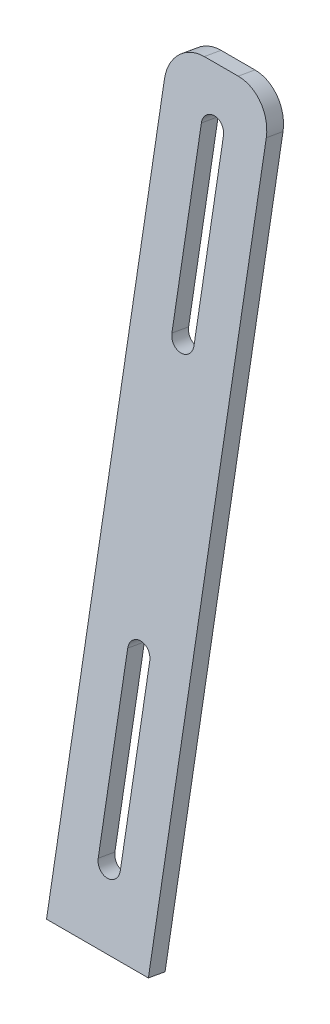
ISO-10303-21;
HEADER;
FILE_DESCRIPTION(('STEP AP214'),'2;1');
FILE_NAME('part.step','',(''),(''),'','','');
FILE_SCHEMA(('AUTOMOTIVE_DESIGN { 1 0 10303 214 1 1 1 1 }'));
ENDSEC;
DATA;
#1=APPLICATION_CONTEXT('core data for automotive mechanical design processes');
#2=APPLICATION_PROTOCOL_DEFINITION('international standard','automotive_design',2000,#1);
#3=PRODUCT_CONTEXT('',#1,'mechanical');
#4=PRODUCT('Part','Part','',(#3));
#5=PRODUCT_RELATED_PRODUCT_CATEGORY('part','',(#4));
#6=PRODUCT_DEFINITION_FORMATION('','',#4);
#7=PRODUCT_DEFINITION_CONTEXT('part definition',#1,'design');
#8=PRODUCT_DEFINITION('design','',#6,#7);
#9=PRODUCT_DEFINITION_SHAPE('','',#8);
#10=(LENGTH_UNIT() NAMED_UNIT(*) SI_UNIT(.MILLI.,.METRE.));
#11=(NAMED_UNIT(*) PLANE_ANGLE_UNIT() SI_UNIT($,.RADIAN.));
#12=(NAMED_UNIT(*) SI_UNIT($,.STERADIAN.) SOLID_ANGLE_UNIT());
#13=UNCERTAINTY_MEASURE_WITH_UNIT(LENGTH_MEASURE(1.E-05),#10,'distance_accuracy_value','');
#14=(GEOMETRIC_REPRESENTATION_CONTEXT(3) GLOBAL_UNCERTAINTY_ASSIGNED_CONTEXT((#13)) GLOBAL_UNIT_ASSIGNED_CONTEXT((#10,
#11,#12)) REPRESENTATION_CONTEXT('',''));
#15=CARTESIAN_POINT('',(0.,0.,0.));
#16=DIRECTION('',(0.,0.,1.));
#17=DIRECTION('',(1.,0.,0.));
#18=AXIS2_PLACEMENT_3D('',#15,#16,#17);
#19=CARTESIAN_POINT('',(-15.,231.809628132565,-597.966117310056));
#20=DIRECTION('',(1.,0.,0.));
#21=DIRECTION('',(0.,0.,-1.));
#22=AXIS2_PLACEMENT_3D('',#19,#20,#21);
#23=PLANE('',#22);
#24=DIRECTION('',(0.,-0.984807753012209,0.173648177666928));
#25=VECTOR('',#24,1.);
#26=CARTESIAN_POINT('',(-15.,231.809628132565,-597.966117310056));
#27=LINE('',#26,#25);
#28=CARTESIAN_POINT('',(-15.,221.961550602443,-596.229635533386));
#29=VERTEX_POINT('',#28);
#30=CARTESIAN_POINT('',(-15.0000000000001,25.0000000000006,-561.5));
#31=VERTEX_POINT('',#30);
#32=EDGE_CURVE('E235',#29,#31,#27,.T.);
#33=ORIENTED_EDGE('',*,*,#32,.F.);
#34=DIRECTION('',(0.,0.173648177666924,0.984807753012209));
#35=VECTOR('',#34,1.);
#36=CARTESIAN_POINT('',(-15.,221.961550602443,-596.229635533386));
#37=LINE('',#36,#35);
#38=CARTESIAN_POINT('',(-15.,221.093309714108,-601.153674298447));
#39=VERTEX_POINT('',#38);
#40=EDGE_CURVE('E57',#29,#39,#37,.F.);
#41=ORIENTED_EDGE('',*,*,#40,.T.);
#42=DIRECTION('',(0.,-0.984807753012209,0.173648177666928));
#43=VECTOR('',#42,1.);
#44=CARTESIAN_POINT('',(-15.0000000000001,230.94138724423,-602.890156075116));
#45=LINE('',#44,#43);
#46=CARTESIAN_POINT('',(-15.,24.1317591116659,-566.424038765062));
#47=VERTEX_POINT('',#46);
#48=EDGE_CURVE('E219',#39,#47,#45,.T.);
#49=ORIENTED_EDGE('',*,*,#48,.T.);
#50=DIRECTION('',(0.,0.173648177666924,0.984807753012209));
#51=VECTOR('',#50,1.);
#52=CARTESIAN_POINT('',(-15.0000000000001,25.0000000000006,-561.5));
#53=LINE('',#52,#51);
#54=EDGE_CURVE('E211',#47,#31,#53,.T.);
#55=ORIENTED_EDGE('',*,*,#54,.T.);
#56=EDGE_LOOP('',(#33,#41,#49,#55));
#57=FACE_BOUND('',#56,.T.);
#58=ADVANCED_FACE('F34',(#57),#23,.F.);
#59=CARTESIAN_POINT('',(-15.,231.809628132565,-597.966117310056));
#60=DIRECTION('',(0.,-0.173648177666926,-0.984807753012209));
#61=DIRECTION('',(0.,0.984807753012209,-0.173648177666928));
#62=AXIS2_PLACEMENT_3D('',#59,#60,#61);
#63=PLANE('',#62);
#64=DIRECTION('',(0.,-0.984807753012209,0.173648177666928));
#65=VECTOR('',#64,1.);
#66=CARTESIAN_POINT('',(3.24999999999999,231.809628132564,-597.966117310056));
#67=LINE('',#66,#65);
#68=CARTESIAN_POINT('',(3.25,93.9365427108549,-573.655372436685));
#69=VERTEX_POINT('',#68);
#70=CARTESIAN_POINT('',(3.25,44.6961550602447,-564.972963553338));
#71=VERTEX_POINT('',#70);
#72=EDGE_CURVE('E205',#69,#71,#67,.T.);
#73=ORIENTED_EDGE('',*,*,#72,.T.);
#74=CARTESIAN_POINT('',(0.,44.6961550602447,-564.972963553339));
#75=DIRECTION('',(0.,-0.173648177666926,-0.984807753012209));
#76=DIRECTION('',(0.,0.984807753012209,-0.173648177666928));
#77=AXIS2_PLACEMENT_3D('',#74,#75,#76);
#78=CIRCLE('',#77,3.25);
#79=CARTESIAN_POINT('',(-3.25,44.6961550602447,-564.972963553338));
#80=VERTEX_POINT('',#79);
#81=EDGE_CURVE('E208',#71,#80,#78,.T.);
#82=ORIENTED_EDGE('',*,*,#81,.T.);
#83=DIRECTION('',(0.,0.984807753012209,-0.173648177666928));
#84=VECTOR('',#83,1.);
#85=CARTESIAN_POINT('',(-3.25000000000002,231.809628132564,-597.966117310056));
#86=LINE('',#85,#84);
#87=CARTESIAN_POINT('',(-3.24999999999999,93.9365427108549,-573.655372436685));
#88=VERTEX_POINT('',#87);
#89=EDGE_CURVE('E202',#80,#88,#86,.T.);
#90=ORIENTED_EDGE('',*,*,#89,.T.);
#91=CARTESIAN_POINT('',(0.,93.9365427108549,-573.655372436685));
#92=DIRECTION('',(0.,-0.173648177666926,-0.984807753012209));
#93=DIRECTION('',(0.,0.984807753012209,-0.173648177666928));
#94=AXIS2_PLACEMENT_3D('',#91,#92,#93);
#95=CIRCLE('',#94,3.25);
#96=EDGE_CURVE('E143',#88,#69,#95,.T.);
#97=ORIENTED_EDGE('',*,*,#96,.T.);
#98=EDGE_LOOP('',(#73,#82,#90,#97));
#99=FACE_BOUND('',#98,.T.);
#100=DIRECTION('',(0.,-0.984807753012209,0.173648177666928));
#101=VECTOR('',#100,1.);
#102=CARTESIAN_POINT('',(3.24999999999996,231.809628132564,-597.966117310056));
#103=LINE('',#102,#101);
#104=CARTESIAN_POINT('',(3.24999999999996,217.037511837381,-595.361394645051));
#105=VERTEX_POINT('',#104);
#106=CARTESIAN_POINT('',(3.24999999999995,167.797124186771,-586.678985761705));
#107=VERTEX_POINT('',#106);
#108=EDGE_CURVE('E196',#105,#107,#103,.T.);
#109=ORIENTED_EDGE('',*,*,#108,.T.);
#110=CARTESIAN_POINT('',(0.,167.797124186771,-586.678985761705));
#111=DIRECTION('',(0.,-0.173648177666926,-0.984807753012209));
#112=DIRECTION('',(0.,0.984807753012209,-0.173648177666928));
#113=AXIS2_PLACEMENT_3D('',#110,#111,#112);
#114=CIRCLE('',#113,3.25);
#115=CARTESIAN_POINT('',(-3.25000000000006,167.797124186771,-586.678985761705));
#116=VERTEX_POINT('',#115);
#117=EDGE_CURVE('E199',#107,#116,#114,.T.);
#118=ORIENTED_EDGE('',*,*,#117,.T.);
#119=DIRECTION('',(0.,0.984807753012209,-0.173648177666928));
#120=VECTOR('',#119,1.);
#121=CARTESIAN_POINT('',(-3.25000000000003,231.809628132564,-597.966117310056));
#122=LINE('',#121,#120);
#123=CARTESIAN_POINT('',(-3.25000000000004,217.037511837381,-595.361394645051));
#124=VERTEX_POINT('',#123);
#125=EDGE_CURVE('E184',#116,#124,#122,.T.);
#126=ORIENTED_EDGE('',*,*,#125,.T.);
#127=CARTESIAN_POINT('',(0.,217.037511837381,-595.361394645051));
#128=DIRECTION('',(0.,-0.173648177666926,-0.984807753012209));
#129=DIRECTION('',(0.,0.984807753012209,-0.173648177666928));
#130=AXIS2_PLACEMENT_3D('',#127,#128,#129);
#131=CIRCLE('',#130,3.25);
#132=EDGE_CURVE('E193',#124,#105,#131,.T.);
#133=ORIENTED_EDGE('',*,*,#132,.T.);
#134=EDGE_LOOP('',(#109,#118,#126,#133));
#135=FACE_BOUND('',#134,.T.);
#136=DIRECTION('',(1.,0.,0.));
#137=VECTOR('',#136,1.);
#138=CARTESIAN_POINT('',(-15.,231.809628132565,-597.966117310056));
#139=LINE('',#138,#137);
#140=CARTESIAN_POINT('',(-5.00000000000005,231.809628132564,-597.966117310056));
#141=VERTEX_POINT('',#140);
#142=CARTESIAN_POINT('',(4.99999999999995,231.809628132565,-597.966117310056));
#143=VERTEX_POINT('',#142);
#144=EDGE_CURVE('E212',#141,#143,#139,.T.);
#145=ORIENTED_EDGE('',*,*,#144,.F.);
#146=CARTESIAN_POINT('',(-5.,221.961550602443,-596.229635533386));
#147=DIRECTION('',(0.,-0.173648177666926,-0.984807753012209));
#148=DIRECTION('',(0.,0.984807753012209,-0.173648177666928));
#149=AXIS2_PLACEMENT_3D('',#146,#147,#148);
#150=CIRCLE('',#149,10.);
#151=EDGE_CURVE('E245',#141,#29,#150,.F.);
#152=ORIENTED_EDGE('',*,*,#151,.T.);
#153=ORIENTED_EDGE('',*,*,#32,.T.);
#154=DIRECTION('',(1.,0.,0.));
#155=VECTOR('',#154,1.);
#156=CARTESIAN_POINT('',(-15.0000000000001,25.0000000000006,-561.5));
#157=LINE('',#156,#155);
#158=CARTESIAN_POINT('',(14.9999999999999,25.0000000000006,-561.5));
#159=VERTEX_POINT('',#158);
#160=EDGE_CURVE('E222',#31,#159,#157,.T.);
#161=ORIENTED_EDGE('',*,*,#160,.T.);
#162=DIRECTION('',(0.,-0.984807753012209,0.173648177666928));
#163=VECTOR('',#162,1.);
#164=CARTESIAN_POINT('',(15.,231.809628132564,-597.966117310056));
#165=LINE('',#164,#163);
#166=CARTESIAN_POINT('',(15.,221.961550602443,-596.229635533386));
#167=VERTEX_POINT('',#166);
#168=EDGE_CURVE('E233',#167,#159,#165,.T.);
#169=ORIENTED_EDGE('',*,*,#168,.F.);
#170=CARTESIAN_POINT('',(4.99999999999999,221.961550602443,-596.229635533386));
#171=DIRECTION('',(0.,-0.173648177666926,-0.984807753012209));
#172=DIRECTION('',(0.,0.984807753012209,-0.173648177666928));
#173=AXIS2_PLACEMENT_3D('',#170,#171,#172);
#174=CIRCLE('',#173,10.);
#175=EDGE_CURVE('E243',#167,#143,#174,.F.);
#176=ORIENTED_EDGE('',*,*,#175,.T.);
#177=EDGE_LOOP('',(#145,#152,#153,#161,#169,#176));
#178=FACE_BOUND('',#177,.T.);
#179=ADVANCED_FACE('F257',(#99,#135,#178),#63,.F.);
#180=CARTESIAN_POINT('',(14.9999999999999,230.94138724423,-602.890156075116));
#181=DIRECTION('',(-1.,0.,0.));
#182=DIRECTION('',(0.,0.,1.));
#183=AXIS2_PLACEMENT_3D('',#180,#181,#182);
#184=PLANE('',#183);
#185=DIRECTION('',(0.,-0.984807753012209,0.173648177666928));
#186=VECTOR('',#185,1.);
#187=CARTESIAN_POINT('',(14.9999999999999,230.94138724423,-602.890156075116));
#188=LINE('',#187,#186);
#189=CARTESIAN_POINT('',(15.,221.093309714108,-601.153674298447));
#190=VERTEX_POINT('',#189);
#191=CARTESIAN_POINT('',(15.,24.1317591116659,-566.424038765062));
#192=VERTEX_POINT('',#191);
#193=EDGE_CURVE('E231',#190,#192,#188,.T.);
#194=ORIENTED_EDGE('',*,*,#193,.F.);
#195=DIRECTION('',(0.,-0.173648177666924,-0.984807753012209));
#196=VECTOR('',#195,1.);
#197=CARTESIAN_POINT('',(15.,221.093309714108,-601.153674298447));
#198=LINE('',#197,#196);
#199=EDGE_CURVE('E11',#190,#167,#198,.F.);
#200=ORIENTED_EDGE('',*,*,#199,.T.);
#201=ORIENTED_EDGE('',*,*,#168,.T.);
#202=DIRECTION('',(0.,-0.173648177666924,-0.984807753012209));
#203=VECTOR('',#202,1.);
#204=CARTESIAN_POINT('',(15.,24.1317591116659,-566.424038765062));
#205=LINE('',#204,#203);
#206=EDGE_CURVE('E225',#159,#192,#205,.T.);
#207=ORIENTED_EDGE('',*,*,#206,.T.);
#208=EDGE_LOOP('',(#194,#200,#201,#207));
#209=FACE_BOUND('',#208,.T.);
#210=ADVANCED_FACE('F269',(#209),#184,.F.);
#211=CARTESIAN_POINT('',(-15.0000000000001,230.94138724423,-602.890156075116));
#212=DIRECTION('',(0.,0.173648177666926,0.984807753012209));
#213=DIRECTION('',(0.,-0.984807753012209,0.173648177666928));
#214=AXIS2_PLACEMENT_3D('',#211,#212,#213);
#215=PLANE('',#214);
#216=DIRECTION('',(0.,0.984807753012209,-0.173648177666926));
#217=VECTOR('',#216,1.);
#218=CARTESIAN_POINT('',(-3.25,43.8279141719098,-569.897002318399));
#219=LINE('',#218,#217);
#220=CARTESIAN_POINT('',(-3.25,43.8279141719098,-569.8970023184));
#221=VERTEX_POINT('',#220);
#222=CARTESIAN_POINT('',(-3.24999999999999,93.0683018225207,-578.579411201746));
#223=VERTEX_POINT('',#222);
#224=EDGE_CURVE('E151',#221,#223,#219,.T.);
#225=ORIENTED_EDGE('',*,*,#224,.F.);
#226=CARTESIAN_POINT('',(0.,43.8279141719098,-569.897002318399));
#227=DIRECTION('',(0.,-0.173648177666924,-0.984807753012209));
#228=DIRECTION('',(0.,0.984807753012209,-0.173648177666926));
#229=AXIS2_PLACEMENT_3D('',#226,#227,#228);
#230=CIRCLE('',#229,3.25);
#231=CARTESIAN_POINT('',(3.24999999999999,43.8279141719098,-569.897002318399));
#232=VERTEX_POINT('',#231);
#233=EDGE_CURVE('E156',#232,#221,#230,.T.);
#234=ORIENTED_EDGE('',*,*,#233,.F.);
#235=DIRECTION('',(0.,-0.984807753012209,0.173648177666926));
#236=VECTOR('',#235,1.);
#237=CARTESIAN_POINT('',(3.24999999999999,43.8279141719098,-569.897002318399));
#238=LINE('',#237,#236);
#239=CARTESIAN_POINT('',(3.25,93.0683018225207,-578.579411201746));
#240=VERTEX_POINT('',#239);
#241=EDGE_CURVE('E161',#240,#232,#238,.T.);
#242=ORIENTED_EDGE('',*,*,#241,.F.);
#243=CARTESIAN_POINT('',(0.,93.0683018225207,-578.579411201746));
#244=DIRECTION('',(0.,-0.173648177666924,-0.984807753012209));
#245=DIRECTION('',(0.,0.984807753012209,-0.173648177666926));
#246=AXIS2_PLACEMENT_3D('',#243,#244,#245);
#247=CIRCLE('',#246,3.25);
#248=EDGE_CURVE('E140',#223,#240,#247,.T.);
#249=ORIENTED_EDGE('',*,*,#248,.F.);
#250=EDGE_LOOP('',(#225,#234,#242,#249));
#251=FACE_BOUND('',#250,.T.);
#252=DIRECTION('',(0.,0.984807753012209,-0.173648177666926));
#253=VECTOR('',#252,1.);
#254=CARTESIAN_POINT('',(-3.25,166.928883298436,-591.603024526766));
#255=LINE('',#254,#253);
#256=CARTESIAN_POINT('',(-3.25,166.928883298436,-591.603024526766));
#257=VERTEX_POINT('',#256);
#258=CARTESIAN_POINT('',(-3.25000000000004,216.169270949047,-600.285433410112));
#259=VERTEX_POINT('',#258);
#260=EDGE_CURVE('E172',#257,#259,#255,.T.);
#261=ORIENTED_EDGE('',*,*,#260,.F.);
#262=CARTESIAN_POINT('',(0.,166.928883298436,-591.603024526766));
#263=DIRECTION('',(0.,-0.173648177666924,-0.984807753012209));
#264=DIRECTION('',(0.,0.984807753012209,-0.173648177666926));
#265=AXIS2_PLACEMENT_3D('',#262,#263,#264);
#266=CIRCLE('',#265,3.25);
#267=CARTESIAN_POINT('',(3.25,166.928883298436,-591.603024526766));
#268=VERTEX_POINT('',#267);
#269=EDGE_CURVE('E168',#268,#257,#266,.T.);
#270=ORIENTED_EDGE('',*,*,#269,.F.);
#271=DIRECTION('',(0.,-0.984807753012209,0.173648177666926));
#272=VECTOR('',#271,1.);
#273=CARTESIAN_POINT('',(3.25,166.928883298436,-591.603024526766));
#274=LINE('',#273,#272);
#275=CARTESIAN_POINT('',(3.24999999999996,216.169270949047,-600.285433410112));
#276=VERTEX_POINT('',#275);
#277=EDGE_CURVE('E178',#276,#268,#274,.T.);
#278=ORIENTED_EDGE('',*,*,#277,.F.);
#279=CARTESIAN_POINT('',(0.,216.169270949047,-600.285433410112));
#280=DIRECTION('',(0.,-0.173648177666924,-0.984807753012209));
#281=DIRECTION('',(0.,0.984807753012209,-0.173648177666926));
#282=AXIS2_PLACEMENT_3D('',#279,#280,#281);
#283=CIRCLE('',#282,3.25);
#284=EDGE_CURVE('E175',#259,#276,#283,.T.);
#285=ORIENTED_EDGE('',*,*,#284,.F.);
#286=EDGE_LOOP('',(#261,#270,#278,#285));
#287=FACE_BOUND('',#286,.T.);
#288=ORIENTED_EDGE('',*,*,#48,.F.);
#289=CARTESIAN_POINT('',(-5.,221.093309714108,-601.153674298447));
#290=DIRECTION('',(0.,0.173648177666926,0.984807753012209));
#291=DIRECTION('',(0.,-0.984807753012209,0.173648177666928));
#292=AXIS2_PLACEMENT_3D('',#289,#290,#291);
#293=CIRCLE('',#292,10.);
#294=CARTESIAN_POINT('',(-5.00000000000005,230.94138724423,-602.890156075116));
#295=VERTEX_POINT('',#294);
#296=EDGE_CURVE('E42',#39,#295,#293,.F.);
#297=ORIENTED_EDGE('',*,*,#296,.T.);
#298=DIRECTION('',(-1.,0.,0.));
#299=VECTOR('',#298,1.);
#300=CARTESIAN_POINT('',(-15.0000000000001,230.94138724423,-602.890156075116));
#301=LINE('',#300,#299);
#302=CARTESIAN_POINT('',(4.99999999999995,230.94138724423,-602.890156075116));
#303=VERTEX_POINT('',#302);
#304=EDGE_CURVE('E215',#303,#295,#301,.T.);
#305=ORIENTED_EDGE('',*,*,#304,.F.);
#306=CARTESIAN_POINT('',(4.99999999999999,221.093309714108,-601.153674298447));
#307=DIRECTION('',(0.,0.173648177666926,0.984807753012209));
#308=DIRECTION('',(0.,-0.984807753012209,0.173648177666928));
#309=AXIS2_PLACEMENT_3D('',#306,#307,#308);
#310=CIRCLE('',#309,10.);
#311=EDGE_CURVE('E49',#303,#190,#310,.F.);
#312=ORIENTED_EDGE('',*,*,#311,.T.);
#313=ORIENTED_EDGE('',*,*,#193,.T.);
#314=DIRECTION('',(-1.,0.,0.));
#315=VECTOR('',#314,1.);
#316=CARTESIAN_POINT('',(-15.,24.1317591116659,-566.424038765062));
#317=LINE('',#316,#315);
#318=EDGE_CURVE('E216',#192,#47,#317,.T.);
#319=ORIENTED_EDGE('',*,*,#318,.T.);
#320=EDGE_LOOP('',(#288,#297,#305,#312,#313,#319));
#321=FACE_BOUND('',#320,.T.);
#322=ADVANCED_FACE('F158',(#251,#287,#321),#215,.F.);
#323=CARTESIAN_POINT('',(0.,326.6438206869,-60.1346851985114));
#324=DIRECTION('',(0.,-0.984807753012209,0.173648177666926));
#325=DIRECTION('',(0.,-0.173648177666924,-0.984807753012209));
#326=AXIS2_PLACEMENT_3D('',#323,#324,#325);
#327=PLANE('',#326);
#328=ORIENTED_EDGE('',*,*,#304,.T.);
#329=DIRECTION('',(0.,0.173648177666924,0.984807753012209));
#330=VECTOR('',#329,1.);
#331=CARTESIAN_POINT('',(-5.00000000000005,326.6438206869,-60.1346851985114));
#332=LINE('',#331,#330);
#333=EDGE_CURVE('E240',#295,#141,#332,.T.);
#334=ORIENTED_EDGE('',*,*,#333,.T.);
#335=ORIENTED_EDGE('',*,*,#144,.T.);
#336=DIRECTION('',(0.,-0.173648177666924,-0.984807753012209));
#337=VECTOR('',#336,1.);
#338=CARTESIAN_POINT('',(4.99999999999995,326.6438206869,-60.1346851985114));
#339=LINE('',#338,#337);
#340=EDGE_CURVE('E237',#143,#303,#339,.T.);
#341=ORIENTED_EDGE('',*,*,#340,.T.);
#342=EDGE_LOOP('',(#328,#334,#335,#341));
#343=FACE_BOUND('',#342,.T.);
#344=ADVANCED_FACE('F252',(#343),#327,.F.);
#345=CARTESIAN_POINT('',(0.,119.834192554335,-23.6685678884564));
#346=DIRECTION('',(0.,-0.984807753012209,0.173648177666926));
#347=DIRECTION('',(0.,-0.173648177666924,-0.984807753012209));
#348=AXIS2_PLACEMENT_3D('',#345,#346,#347);
#349=PLANE('',#348);
#350=ORIENTED_EDGE('',*,*,#54,.F.);
#351=ORIENTED_EDGE('',*,*,#318,.F.);
#352=ORIENTED_EDGE('',*,*,#206,.F.);
#353=ORIENTED_EDGE('',*,*,#160,.F.);
#354=EDGE_LOOP('',(#350,#351,#352,#353));
#355=FACE_BOUND('',#354,.T.);
#356=ADVANCED_FACE('F262',(#355),#349,.T.);
#357=CARTESIAN_POINT('',(0.,271.423433333209,1.01501733459705));
#358=DIRECTION('',(0.,-0.173648177666924,-0.984807753012209));
#359=DIRECTION('',(0.,0.984807753012209,-0.173648177666926));
#360=AXIS2_PLACEMENT_3D('',#357,#358,#359);
#361=CYLINDRICAL_SURFACE('',#360,3.25);
#362=DIRECTION('',(0.,-0.173648177666924,-0.984807753012209));
#363=VECTOR('',#362,1.);
#364=CARTESIAN_POINT('',(3.25,271.423433333209,1.01501733459705));
#365=LINE('',#364,#363);
#366=EDGE_CURVE('E182',#107,#268,#365,.T.);
#367=ORIENTED_EDGE('',*,*,#366,.T.);
#368=ORIENTED_EDGE('',*,*,#269,.T.);
#369=DIRECTION('',(0.,-0.173648177666924,-0.984807753012209));
#370=VECTOR('',#369,1.);
#371=CARTESIAN_POINT('',(-3.25,271.423433333209,1.01501733459705));
#372=LINE('',#371,#370);
#373=EDGE_CURVE('E181',#116,#257,#372,.T.);
#374=ORIENTED_EDGE('',*,*,#373,.F.);
#375=ORIENTED_EDGE('',*,*,#117,.F.);
#376=EDGE_LOOP('',(#367,#368,#374,#375));
#377=FACE_BOUND('',#376,.T.);
#378=ADVANCED_FACE('F305',(#377),#361,.F.);
#379=CARTESIAN_POINT('',(3.25,271.423433333209,1.01501733459705));
#380=DIRECTION('',(1.,0.,0.));
#381=DIRECTION('',(0.,1.,0.));
#382=AXIS2_PLACEMENT_3D('',#379,#380,#381);
#383=PLANE('',#382);
#384=DIRECTION('',(0.,-0.173648177666924,-0.984807753012209));
#385=VECTOR('',#384,1.);
#386=CARTESIAN_POINT('',(3.25,320.66382098382,-7.66739154874922));
#387=LINE('',#386,#385);
#388=EDGE_CURVE('E185',#105,#276,#387,.T.);
#389=ORIENTED_EDGE('',*,*,#388,.T.);
#390=ORIENTED_EDGE('',*,*,#277,.T.);
#391=ORIENTED_EDGE('',*,*,#366,.F.);
#392=ORIENTED_EDGE('',*,*,#108,.F.);
#393=EDGE_LOOP('',(#389,#390,#391,#392));
#394=FACE_BOUND('',#393,.T.);
#395=ADVANCED_FACE('F301',(#394),#383,.F.);
#396=CARTESIAN_POINT('',(0.,320.66382098382,-7.66739154874922));
#397=DIRECTION('',(0.,-0.173648177666924,-0.984807753012209));
#398=DIRECTION('',(0.,0.984807753012209,-0.173648177666926));
#399=AXIS2_PLACEMENT_3D('',#396,#397,#398);
#400=CYLINDRICAL_SURFACE('',#399,3.25);
#401=DIRECTION('',(0.,-0.173648177666924,-0.984807753012209));
#402=VECTOR('',#401,1.);
#403=CARTESIAN_POINT('',(-3.24999999999999,320.66382098382,-7.66739154874922));
#404=LINE('',#403,#402);
#405=EDGE_CURVE('E187',#124,#259,#404,.T.);
#406=ORIENTED_EDGE('',*,*,#405,.T.);
#407=ORIENTED_EDGE('',*,*,#284,.T.);
#408=ORIENTED_EDGE('',*,*,#388,.F.);
#409=ORIENTED_EDGE('',*,*,#132,.F.);
#410=EDGE_LOOP('',(#406,#407,#408,#409));
#411=FACE_BOUND('',#410,.T.);
#412=ADVANCED_FACE('F304',(#411),#400,.F.);
#413=CARTESIAN_POINT('',(-3.25,271.423433333209,1.01501733459705));
#414=DIRECTION('',(-1.,0.,0.));
#415=DIRECTION('',(0.,-1.,0.));
#416=AXIS2_PLACEMENT_3D('',#413,#414,#415);
#417=PLANE('',#416);
#418=ORIENTED_EDGE('',*,*,#373,.T.);
#419=ORIENTED_EDGE('',*,*,#260,.T.);
#420=ORIENTED_EDGE('',*,*,#405,.F.);
#421=ORIENTED_EDGE('',*,*,#125,.F.);
#422=EDGE_LOOP('',(#418,#419,#420,#421));
#423=FACE_BOUND('',#422,.T.);
#424=ADVANCED_FACE('F299',(#423),#417,.F.);
#425=CARTESIAN_POINT('',(0.,148.322464206683,22.7210395429629));
#426=DIRECTION('',(0.,-0.173648177666924,-0.984807753012209));
#427=DIRECTION('',(0.,0.984807753012209,-0.173648177666926));
#428=AXIS2_PLACEMENT_3D('',#425,#426,#427);
#429=CYLINDRICAL_SURFACE('',#428,3.25);
#430=DIRECTION('',(0.,-0.173648177666924,-0.984807753012209));
#431=VECTOR('',#430,1.);
#432=CARTESIAN_POINT('',(3.24999999999995,148.322464206683,22.7210395429629));
#433=LINE('',#432,#431);
#434=EDGE_CURVE('E166',#71,#232,#433,.T.);
#435=ORIENTED_EDGE('',*,*,#434,.T.);
#436=ORIENTED_EDGE('',*,*,#233,.T.);
#437=DIRECTION('',(0.,-0.173648177666924,-0.984807753012209));
#438=VECTOR('',#437,1.);
#439=CARTESIAN_POINT('',(-3.25000000000004,148.322464206683,22.7210395429629));
#440=LINE('',#439,#438);
#441=EDGE_CURVE('E147',#80,#221,#440,.T.);
#442=ORIENTED_EDGE('',*,*,#441,.F.);
#443=ORIENTED_EDGE('',*,*,#81,.F.);
#444=EDGE_LOOP('',(#435,#436,#442,#443));
#445=FACE_BOUND('',#444,.T.);
#446=ADVANCED_FACE('F296',(#445),#429,.F.);
#447=CARTESIAN_POINT('',(3.24999999999995,148.322464206683,22.7210395429629));
#448=DIRECTION('',(1.,0.,0.));
#449=DIRECTION('',(0.,1.,0.));
#450=AXIS2_PLACEMENT_3D('',#447,#448,#449);
#451=PLANE('',#450);
#452=DIRECTION('',(0.,-0.173648177666924,-0.984807753012209));
#453=VECTOR('',#452,1.);
#454=CARTESIAN_POINT('',(3.25,197.562851857294,14.038630659616));
#455=LINE('',#454,#453);
#456=EDGE_CURVE('E146',#69,#240,#455,.T.);
#457=ORIENTED_EDGE('',*,*,#456,.T.);
#458=ORIENTED_EDGE('',*,*,#241,.T.);
#459=ORIENTED_EDGE('',*,*,#434,.F.);
#460=ORIENTED_EDGE('',*,*,#72,.F.);
#461=EDGE_LOOP('',(#457,#458,#459,#460));
#462=FACE_BOUND('',#461,.T.);
#463=ADVANCED_FACE('F292',(#462),#451,.F.);
#464=CARTESIAN_POINT('',(0.,197.562851857294,14.038630659616));
#465=DIRECTION('',(0.,-0.173648177666924,-0.984807753012209));
#466=DIRECTION('',(0.,0.984807753012209,-0.173648177666926));
#467=AXIS2_PLACEMENT_3D('',#464,#465,#466);
#468=CYLINDRICAL_SURFACE('',#467,3.25);
#469=DIRECTION('',(0.,-0.173648177666924,-0.984807753012209));
#470=VECTOR('',#469,1.);
#471=CARTESIAN_POINT('',(-3.25,197.562851857294,14.038630659616));
#472=LINE('',#471,#470);
#473=EDGE_CURVE('E135',#88,#223,#472,.T.);
#474=ORIENTED_EDGE('',*,*,#473,.T.);
#475=ORIENTED_EDGE('',*,*,#248,.T.);
#476=ORIENTED_EDGE('',*,*,#456,.F.);
#477=ORIENTED_EDGE('',*,*,#96,.F.);
#478=EDGE_LOOP('',(#474,#475,#476,#477));
#479=FACE_BOUND('',#478,.T.);
#480=ADVANCED_FACE('F137',(#479),#468,.F.);
#481=CARTESIAN_POINT('',(-3.25000000000004,148.322464206683,22.7210395429629));
#482=DIRECTION('',(-1.,0.,0.));
#483=DIRECTION('',(0.,-1.,0.));
#484=AXIS2_PLACEMENT_3D('',#481,#482,#483);
#485=PLANE('',#484);
#486=ORIENTED_EDGE('',*,*,#441,.T.);
#487=ORIENTED_EDGE('',*,*,#224,.T.);
#488=ORIENTED_EDGE('',*,*,#473,.F.);
#489=ORIENTED_EDGE('',*,*,#89,.F.);
#490=EDGE_LOOP('',(#486,#487,#488,#489));
#491=FACE_BOUND('',#490,.T.);
#492=ADVANCED_FACE('F152',(#491),#485,.F.);
#493=CARTESIAN_POINT('',(-5.,316.795743156778,-58.3982034218421));
#494=DIRECTION('',(0.,0.173648177666924,0.984807753012209));
#495=DIRECTION('',(0.,-0.984807753012209,0.173648177666926));
#496=AXIS2_PLACEMENT_3D('',#493,#494,#495);
#497=CYLINDRICAL_SURFACE('',#496,10.);
#498=ORIENTED_EDGE('',*,*,#296,.F.);
#499=ORIENTED_EDGE('',*,*,#40,.F.);
#500=ORIENTED_EDGE('',*,*,#151,.F.);
#501=ORIENTED_EDGE('',*,*,#333,.F.);
#502=EDGE_LOOP('',(#498,#499,#500,#501));
#503=FACE_BOUND('',#502,.T.);
#504=ADVANCED_FACE('F255',(#503),#497,.T.);
#505=CARTESIAN_POINT('',(4.99999999999999,316.795743156778,-58.3982034218421));
#506=DIRECTION('',(0.,-0.173648177666924,-0.984807753012209));
#507=DIRECTION('',(0.,0.984807753012209,-0.173648177666926));
#508=AXIS2_PLACEMENT_3D('',#505,#506,#507);
#509=CYLINDRICAL_SURFACE('',#508,10.);
#510=ORIENTED_EDGE('',*,*,#175,.F.);
#511=ORIENTED_EDGE('',*,*,#199,.F.);
#512=ORIENTED_EDGE('',*,*,#311,.F.);
#513=ORIENTED_EDGE('',*,*,#340,.F.);
#514=EDGE_LOOP('',(#510,#511,#512,#513));
#515=FACE_BOUND('',#514,.T.);
#516=ADVANCED_FACE('F36',(#515),#509,.T.);
#517=CLOSED_SHELL('',(#58,#179,#210,#322,#344,#356,#378,#395,#412,#424,#446,#463,#480,#492,#504,#516));
#518=MANIFOLD_SOLID_BREP('B2',#517);
#519=ADVANCED_BREP_SHAPE_REPRESENTATION('',(#18,#518),#14);
#520=SHAPE_DEFINITION_REPRESENTATION(#9,#519);
ENDSEC;
END-ISO-10303-21;
